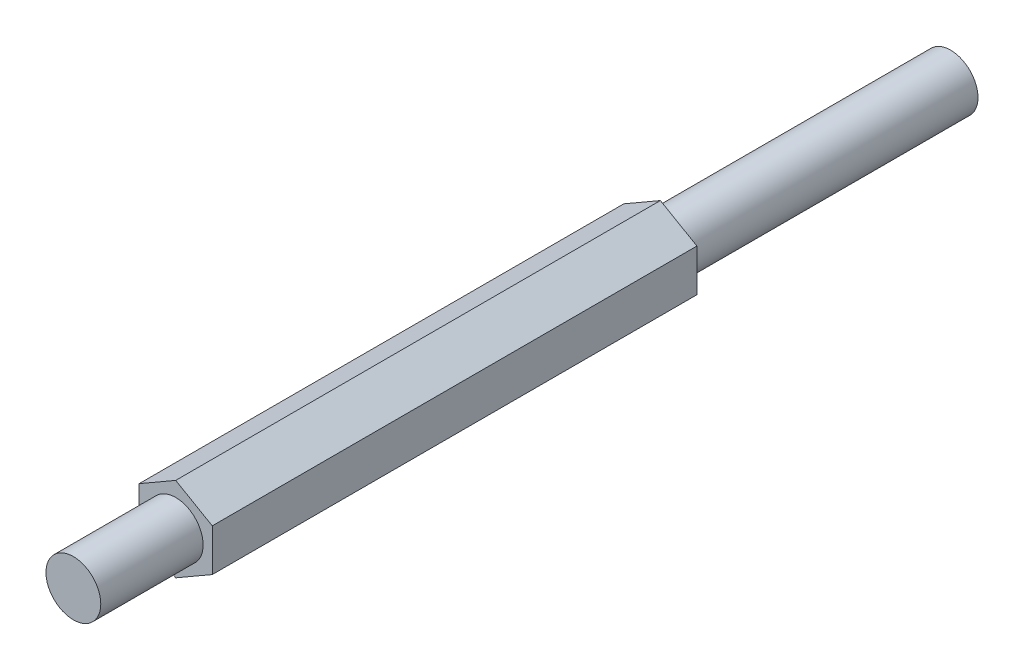
ISO-10303-21;
HEADER;
FILE_DESCRIPTION(('STEP AP214'),'2;1');
FILE_NAME('part.step','',(''),(''),'','','');
FILE_SCHEMA(('AUTOMOTIVE_DESIGN { 1 0 10303 214 1 1 1 1 }'));
ENDSEC;
DATA;
#1=APPLICATION_CONTEXT('core data for automotive mechanical design processes');
#2=APPLICATION_PROTOCOL_DEFINITION('international standard','automotive_design',2000,#1);
#3=PRODUCT_CONTEXT('',#1,'mechanical');
#4=PRODUCT('Part','Part','',(#3));
#5=PRODUCT_RELATED_PRODUCT_CATEGORY('part','',(#4));
#6=PRODUCT_DEFINITION_FORMATION('','',#4);
#7=PRODUCT_DEFINITION_CONTEXT('part definition',#1,'design');
#8=PRODUCT_DEFINITION('design','',#6,#7);
#9=PRODUCT_DEFINITION_SHAPE('','',#8);
#10=(LENGTH_UNIT() NAMED_UNIT(*) SI_UNIT(.MILLI.,.METRE.));
#11=(NAMED_UNIT(*) PLANE_ANGLE_UNIT() SI_UNIT($,.RADIAN.));
#12=(NAMED_UNIT(*) SI_UNIT($,.STERADIAN.) SOLID_ANGLE_UNIT());
#13=UNCERTAINTY_MEASURE_WITH_UNIT(LENGTH_MEASURE(1.E-05),#10,'distance_accuracy_value','');
#14=(GEOMETRIC_REPRESENTATION_CONTEXT(3) GLOBAL_UNCERTAINTY_ASSIGNED_CONTEXT((#13)) GLOBAL_UNIT_ASSIGNED_CONTEXT((#10,
#11,#12)) REPRESENTATION_CONTEXT('',''));
#15=CARTESIAN_POINT('',(0.,0.,0.));
#16=DIRECTION('',(0.,0.,1.));
#17=DIRECTION('',(1.,0.,0.));
#18=AXIS2_PLACEMENT_3D('',#15,#16,#17);
#19=CARTESIAN_POINT('',(-12.7,0.,-51.562));
#20=DIRECTION('',(-1.,0.,0.));
#21=DIRECTION('',(0.,0.,1.));
#22=AXIS2_PLACEMENT_3D('',#19,#20,#21);
#23=PLANE('',#22);
#24=DIRECTION('',(0.,0.,1.));
#25=VECTOR('',#24,1.);
#26=CARTESIAN_POINT('',(-12.7,-7.33234841870825,-51.562));
#27=LINE('',#26,#25);
#28=CARTESIAN_POINT('',(-12.7,-7.33234841870825,-51.562));
#29=VERTEX_POINT('',#28);
#30=CARTESIAN_POINT('',(-12.7,-7.33234841870825,116.84));
#31=VERTEX_POINT('',#30);
#32=EDGE_CURVE('E86',#29,#31,#27,.T.);
#33=ORIENTED_EDGE('',*,*,#32,.T.);
#34=DIRECTION('',(0.,-1.,0.));
#35=VECTOR('',#34,1.);
#36=CARTESIAN_POINT('',(-12.7,0.,116.84));
#37=LINE('',#36,#35);
#38=CARTESIAN_POINT('',(-12.7,7.33234841870825,116.84));
#39=VERTEX_POINT('',#38);
#40=EDGE_CURVE('E89',#39,#31,#37,.T.);
#41=ORIENTED_EDGE('',*,*,#40,.F.);
#42=DIRECTION('',(0.,0.,1.));
#43=VECTOR('',#42,1.);
#44=CARTESIAN_POINT('',(-12.7,7.33234841870825,-51.562));
#45=LINE('',#44,#43);
#46=CARTESIAN_POINT('',(-12.7,7.33234841870825,-51.562));
#47=VERTEX_POINT('',#46);
#48=EDGE_CURVE('E42',#47,#39,#45,.T.);
#49=ORIENTED_EDGE('',*,*,#48,.F.);
#50=DIRECTION('',(0.,-1.,0.));
#51=VECTOR('',#50,1.);
#52=CARTESIAN_POINT('',(-12.7,0.,-51.562));
#53=LINE('',#52,#51);
#54=EDGE_CURVE('E90',#47,#29,#53,.T.);
#55=ORIENTED_EDGE('',*,*,#54,.T.);
#56=EDGE_LOOP('',(#33,#41,#49,#55));
#57=FACE_BOUND('',#56,.T.);
#58=ADVANCED_FACE('F34',(#57),#23,.T.);
#59=CARTESIAN_POINT('',(-6.35,10.9985226280624,-51.562));
#60=DIRECTION('',(-0.5,0.866025403784439,0.));
#61=DIRECTION('',(-0.866025403784439,-0.5,0.));
#62=AXIS2_PLACEMENT_3D('',#59,#60,#61);
#63=PLANE('',#62);
#64=ORIENTED_EDGE('',*,*,#48,.T.);
#65=DIRECTION('',(-0.866025403784439,-0.5,0.));
#66=VECTOR('',#65,1.);
#67=CARTESIAN_POINT('',(-6.35,10.9985226280624,116.84));
#68=LINE('',#67,#66);
#69=CARTESIAN_POINT('',(0.,14.6646968374165,116.84));
#70=VERTEX_POINT('',#69);
#71=EDGE_CURVE('E107',#70,#39,#68,.T.);
#72=ORIENTED_EDGE('',*,*,#71,.F.);
#73=DIRECTION('',(0.,0.,1.));
#74=VECTOR('',#73,1.);
#75=CARTESIAN_POINT('',(0.,14.6646968374165,-51.562));
#76=LINE('',#75,#74);
#77=CARTESIAN_POINT('',(0.,14.6646968374165,-51.562));
#78=VERTEX_POINT('',#77);
#79=EDGE_CURVE('E57',#78,#70,#76,.T.);
#80=ORIENTED_EDGE('',*,*,#79,.F.);
#81=DIRECTION('',(-0.866025403784439,-0.5,0.));
#82=VECTOR('',#81,1.);
#83=CARTESIAN_POINT('',(-6.35,10.9985226280624,-51.562));
#84=LINE('',#83,#82);
#85=EDGE_CURVE('E95',#78,#47,#84,.T.);
#86=ORIENTED_EDGE('',*,*,#85,.T.);
#87=EDGE_LOOP('',(#64,#72,#80,#86));
#88=FACE_BOUND('',#87,.T.);
#89=ADVANCED_FACE('F152',(#88),#63,.T.);
#90=CARTESIAN_POINT('',(6.35,10.9985226280624,-51.562));
#91=DIRECTION('',(0.5,0.866025403784439,0.));
#92=DIRECTION('',(-0.866025403784439,0.5,0.));
#93=AXIS2_PLACEMENT_3D('',#90,#91,#92);
#94=PLANE('',#93);
#95=ORIENTED_EDGE('',*,*,#79,.T.);
#96=DIRECTION('',(-0.866025403784439,0.5,0.));
#97=VECTOR('',#96,1.);
#98=CARTESIAN_POINT('',(6.35,10.9985226280624,116.84));
#99=LINE('',#98,#97);
#100=CARTESIAN_POINT('',(12.7,7.33234841870826,116.84));
#101=VERTEX_POINT('',#100);
#102=EDGE_CURVE('E117',#101,#70,#99,.T.);
#103=ORIENTED_EDGE('',*,*,#102,.F.);
#104=DIRECTION('',(0.,0.,1.));
#105=VECTOR('',#104,1.);
#106=CARTESIAN_POINT('',(12.7,7.33234841870826,-51.562));
#107=LINE('',#106,#105);
#108=CARTESIAN_POINT('',(12.7,7.33234841870826,-51.562));
#109=VERTEX_POINT('',#108);
#110=EDGE_CURVE('E134',#109,#101,#107,.T.);
#111=ORIENTED_EDGE('',*,*,#110,.F.);
#112=DIRECTION('',(-0.866025403784439,0.5,0.));
#113=VECTOR('',#112,1.);
#114=CARTESIAN_POINT('',(6.35,10.9985226280624,-51.562));
#115=LINE('',#114,#113);
#116=EDGE_CURVE('E129',#109,#78,#115,.T.);
#117=ORIENTED_EDGE('',*,*,#116,.T.);
#118=EDGE_LOOP('',(#95,#103,#111,#117));
#119=FACE_BOUND('',#118,.T.);
#120=ADVANCED_FACE('F148',(#119),#94,.T.);
#121=CARTESIAN_POINT('',(12.7,0.,-51.562));
#122=DIRECTION('',(1.,0.,0.));
#123=DIRECTION('',(0.,1.,0.));
#124=AXIS2_PLACEMENT_3D('',#121,#122,#123);
#125=PLANE('',#124);
#126=ORIENTED_EDGE('',*,*,#110,.T.);
#127=DIRECTION('',(0.,1.,0.));
#128=VECTOR('',#127,1.);
#129=CARTESIAN_POINT('',(12.7,0.,116.84));
#130=LINE('',#129,#128);
#131=CARTESIAN_POINT('',(12.7,-7.33234841870825,116.84));
#132=VERTEX_POINT('',#131);
#133=EDGE_CURVE('E114',#132,#101,#130,.T.);
#134=ORIENTED_EDGE('',*,*,#133,.F.);
#135=DIRECTION('',(0.,0.,1.));
#136=VECTOR('',#135,1.);
#137=CARTESIAN_POINT('',(12.7,-7.33234841870825,-51.562));
#138=LINE('',#137,#136);
#139=CARTESIAN_POINT('',(12.7,-7.33234841870825,-51.562));
#140=VERTEX_POINT('',#139);
#141=EDGE_CURVE('E136',#140,#132,#138,.T.);
#142=ORIENTED_EDGE('',*,*,#141,.F.);
#143=DIRECTION('',(0.,1.,0.));
#144=VECTOR('',#143,1.);
#145=CARTESIAN_POINT('',(12.7,0.,-51.562));
#146=LINE('',#145,#144);
#147=EDGE_CURVE('E126',#140,#109,#146,.T.);
#148=ORIENTED_EDGE('',*,*,#147,.T.);
#149=EDGE_LOOP('',(#126,#134,#142,#148));
#150=FACE_BOUND('',#149,.T.);
#151=ADVANCED_FACE('F145',(#150),#125,.T.);
#152=CARTESIAN_POINT('',(6.34999999999999,-10.9985226280624,-51.562));
#153=DIRECTION('',(0.5,-0.866025403784439,0.));
#154=DIRECTION('',(0.866025403784439,0.5,0.));
#155=AXIS2_PLACEMENT_3D('',#152,#153,#154);
#156=PLANE('',#155);
#157=ORIENTED_EDGE('',*,*,#141,.T.);
#158=DIRECTION('',(0.866025403784439,0.5,0.));
#159=VECTOR('',#158,1.);
#160=CARTESIAN_POINT('',(6.34999999999999,-10.9985226280624,116.84));
#161=LINE('',#160,#159);
#162=CARTESIAN_POINT('',(0.,-14.6646968374165,116.84));
#163=VERTEX_POINT('',#162);
#164=EDGE_CURVE('E102',#163,#132,#161,.T.);
#165=ORIENTED_EDGE('',*,*,#164,.F.);
#166=DIRECTION('',(0.,0.,1.));
#167=VECTOR('',#166,1.);
#168=CARTESIAN_POINT('',(0.,-14.6646968374165,-51.562));
#169=LINE('',#168,#167);
#170=CARTESIAN_POINT('',(0.,-14.6646968374165,-51.562));
#171=VERTEX_POINT('',#170);
#172=EDGE_CURVE('E94',#171,#163,#169,.T.);
#173=ORIENTED_EDGE('',*,*,#172,.F.);
#174=DIRECTION('',(0.866025403784439,0.5,0.));
#175=VECTOR('',#174,1.);
#176=CARTESIAN_POINT('',(6.34999999999999,-10.9985226280624,-51.562));
#177=LINE('',#176,#175);
#178=EDGE_CURVE('E123',#171,#140,#177,.T.);
#179=ORIENTED_EDGE('',*,*,#178,.T.);
#180=EDGE_LOOP('',(#157,#165,#173,#179));
#181=FACE_BOUND('',#180,.T.);
#182=ADVANCED_FACE('F139',(#181),#156,.T.);
#183=CARTESIAN_POINT('',(-6.35,-10.9985226280624,-51.562));
#184=DIRECTION('',(-0.5,-0.866025403784439,0.));
#185=DIRECTION('',(0.866025403784439,-0.5,0.));
#186=AXIS2_PLACEMENT_3D('',#183,#184,#185);
#187=PLANE('',#186);
#188=ORIENTED_EDGE('',*,*,#172,.T.);
#189=DIRECTION('',(0.866025403784439,-0.5,0.));
#190=VECTOR('',#189,1.);
#191=CARTESIAN_POINT('',(-6.35,-10.9985226280624,116.84));
#192=LINE('',#191,#190);
#193=EDGE_CURVE('E97',#31,#163,#192,.T.);
#194=ORIENTED_EDGE('',*,*,#193,.F.);
#195=ORIENTED_EDGE('',*,*,#32,.F.);
#196=DIRECTION('',(0.866025403784439,-0.5,0.));
#197=VECTOR('',#196,1.);
#198=CARTESIAN_POINT('',(-6.35,-10.9985226280624,-51.562));
#199=LINE('',#198,#197);
#200=EDGE_CURVE('E121',#29,#171,#199,.T.);
#201=ORIENTED_EDGE('',*,*,#200,.T.);
#202=EDGE_LOOP('',(#188,#194,#195,#201));
#203=FACE_BOUND('',#202,.T.);
#204=ADVANCED_FACE('F98',(#203),#187,.T.);
#205=CARTESIAN_POINT('',(0.,0.,-51.562));
#206=DIRECTION('',(0.,0.,1.));
#207=DIRECTION('',(1.,0.,0.));
#208=AXIS2_PLACEMENT_3D('',#205,#206,#207);
#209=PLANE('',#208);
#210=CARTESIAN_POINT('',(0.,0.,-51.562));
#211=DIRECTION('',(0.,0.,1.));
#212=DIRECTION('',(1.,0.,0.));
#213=AXIS2_PLACEMENT_3D('',#210,#211,#212);
#214=CIRCLE('',#213,9.525);
#215=CARTESIAN_POINT('',(9.525,0.,-51.562));
#216=VERTEX_POINT('',#215);
#217=EDGE_CURVE('E11',#216,#216,#214,.F.);
#218=ORIENTED_EDGE('',*,*,#217,.F.);
#219=EDGE_LOOP('',(#218));
#220=FACE_BOUND('',#219,.T.);
#221=ORIENTED_EDGE('',*,*,#54,.F.);
#222=ORIENTED_EDGE('',*,*,#85,.F.);
#223=ORIENTED_EDGE('',*,*,#116,.F.);
#224=ORIENTED_EDGE('',*,*,#147,.F.);
#225=ORIENTED_EDGE('',*,*,#178,.F.);
#226=ORIENTED_EDGE('',*,*,#200,.F.);
#227=EDGE_LOOP('',(#221,#222,#223,#224,#225,#226));
#228=FACE_BOUND('',#227,.T.);
#229=ADVANCED_FACE('F151',(#220,#228),#209,.F.);
#230=CARTESIAN_POINT('',(0.,0.,116.84));
#231=DIRECTION('',(0.,0.,1.));
#232=DIRECTION('',(1.,0.,0.));
#233=AXIS2_PLACEMENT_3D('',#230,#231,#232);
#234=PLANE('',#233);
#235=CARTESIAN_POINT('',(0.,0.,116.84));
#236=DIRECTION('',(0.,0.,1.));
#237=DIRECTION('',(1.,0.,0.));
#238=AXIS2_PLACEMENT_3D('',#235,#236,#237);
#239=CIRCLE('',#238,9.525);
#240=CARTESIAN_POINT('',(9.525,0.,116.84));
#241=VERTEX_POINT('',#240);
#242=EDGE_CURVE('E37',#241,#241,#239,.F.);
#243=ORIENTED_EDGE('',*,*,#242,.T.);
#244=EDGE_LOOP('',(#243));
#245=FACE_BOUND('',#244,.T.);
#246=ORIENTED_EDGE('',*,*,#40,.T.);
#247=ORIENTED_EDGE('',*,*,#193,.T.);
#248=ORIENTED_EDGE('',*,*,#164,.T.);
#249=ORIENTED_EDGE('',*,*,#133,.T.);
#250=ORIENTED_EDGE('',*,*,#102,.T.);
#251=ORIENTED_EDGE('',*,*,#71,.T.);
#252=EDGE_LOOP('',(#246,#247,#248,#249,#250,#251));
#253=FACE_BOUND('',#252,.T.);
#254=ADVANCED_FACE('F105',(#245,#253),#234,.T.);
#255=CARTESIAN_POINT('',(0.,0.,152.4));
#256=DIRECTION('',(0.,0.,1.));
#257=DIRECTION('',(1.,0.,0.));
#258=AXIS2_PLACEMENT_3D('',#255,#256,#257);
#259=PLANE('',#258);
#260=CARTESIAN_POINT('',(0.,0.,152.4));
#261=DIRECTION('',(0.,0.,1.));
#262=DIRECTION('',(1.,0.,0.));
#263=AXIS2_PLACEMENT_3D('',#260,#261,#262);
#264=CIRCLE('',#263,9.525);
#265=CARTESIAN_POINT('',(9.525,0.,152.4));
#266=VERTEX_POINT('',#265);
#267=EDGE_CURVE('E110',#266,#266,#264,.T.);
#268=ORIENTED_EDGE('',*,*,#267,.T.);
#269=EDGE_LOOP('',(#268));
#270=FACE_BOUND('',#269,.T.);
#271=ADVANCED_FACE('F174',(#270),#259,.T.);
#272=CARTESIAN_POINT('',(0.,0.,152.4));
#273=DIRECTION('',(0.,0.,-1.));
#274=DIRECTION('',(-1.,0.,0.));
#275=AXIS2_PLACEMENT_3D('',#272,#273,#274);
#276=CYLINDRICAL_SURFACE('',#275,9.525);
#277=ORIENTED_EDGE('',*,*,#242,.F.);
#278=EDGE_LOOP('',(#277));
#279=FACE_BOUND('',#278,.T.);
#280=ORIENTED_EDGE('',*,*,#267,.F.);
#281=EDGE_LOOP('',(#280));
#282=FACE_BOUND('',#281,.T.);
#283=ADVANCED_FACE('F181',(#279,#282),#276,.T.);
#284=CARTESIAN_POINT('',(0.,0.,-152.4));
#285=DIRECTION('',(0.,0.,1.));
#286=DIRECTION('',(1.,0.,0.));
#287=AXIS2_PLACEMENT_3D('',#284,#285,#286);
#288=CIRCLE('',#287,9.525);
#289=CARTESIAN_POINT('',(9.525,0.,-152.4));
#290=VERTEX_POINT('',#289);
#291=EDGE_CURVE('E200',#290,#290,#288,.T.);
#292=ORIENTED_EDGE('',*,*,#291,.T.);
#293=EDGE_LOOP('',(#292));
#294=FACE_BOUND('',#293,.T.);
#295=ORIENTED_EDGE('',*,*,#217,.T.);
#296=EDGE_LOOP('',(#295));
#297=FACE_BOUND('',#296,.T.);
#298=ADVANCED_FACE('F178',(#294,#297),#276,.T.);
#299=CARTESIAN_POINT('',(0.,0.,-152.4));
#300=DIRECTION('',(0.,0.,1.));
#301=DIRECTION('',(1.,0.,0.));
#302=AXIS2_PLACEMENT_3D('',#299,#300,#301);
#303=PLANE('',#302);
#304=ORIENTED_EDGE('',*,*,#291,.F.);
#305=EDGE_LOOP('',(#304));
#306=FACE_BOUND('',#305,.T.);
#307=ADVANCED_FACE('F180',(#306),#303,.F.);
#308=CLOSED_SHELL('',(#58,#89,#120,#151,#182,#204,#229,#254,#271,#283,#298,#307));
#309=MANIFOLD_SOLID_BREP('B2',#308);
#310=ADVANCED_BREP_SHAPE_REPRESENTATION('',(#18,#309),#14);
#311=SHAPE_DEFINITION_REPRESENTATION(#9,#310);
ENDSEC;
END-ISO-10303-21;
